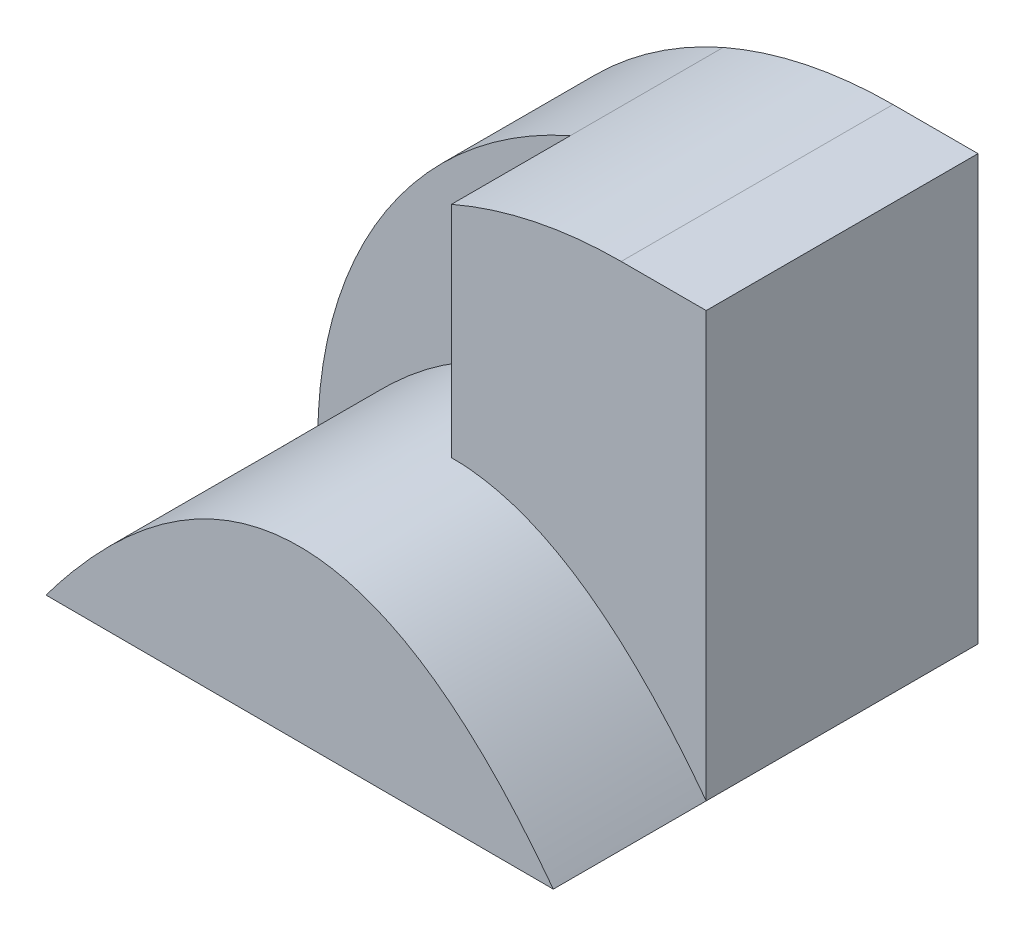
ISO-10303-21;
HEADER;
FILE_DESCRIPTION(('STEP AP214'),'2;1');
FILE_NAME('part.step','',(''),(''),'','','');
FILE_SCHEMA(('AUTOMOTIVE_DESIGN { 1 0 10303 214 1 1 1 1 }'));
ENDSEC;
DATA;
#1=APPLICATION_CONTEXT('core data for automotive mechanical design processes');
#2=APPLICATION_PROTOCOL_DEFINITION('international standard','automotive_design',2000,#1);
#3=PRODUCT_CONTEXT('',#1,'mechanical');
#4=PRODUCT('Part','Part','',(#3));
#5=PRODUCT_RELATED_PRODUCT_CATEGORY('part','',(#4));
#6=PRODUCT_DEFINITION_FORMATION('','',#4);
#7=PRODUCT_DEFINITION_CONTEXT('part definition',#1,'design');
#8=PRODUCT_DEFINITION('design','',#6,#7);
#9=PRODUCT_DEFINITION_SHAPE('','',#8);
#10=(LENGTH_UNIT() NAMED_UNIT(*) SI_UNIT(.MILLI.,.METRE.));
#11=(NAMED_UNIT(*) PLANE_ANGLE_UNIT() SI_UNIT($,.RADIAN.));
#12=(NAMED_UNIT(*) SI_UNIT($,.STERADIAN.) SOLID_ANGLE_UNIT());
#13=UNCERTAINTY_MEASURE_WITH_UNIT(LENGTH_MEASURE(1.E-05),#10,'distance_accuracy_value','');
#14=(GEOMETRIC_REPRESENTATION_CONTEXT(3) GLOBAL_UNCERTAINTY_ASSIGNED_CONTEXT((#13)) GLOBAL_UNIT_ASSIGNED_CONTEXT((#10,
#11,#12)) REPRESENTATION_CONTEXT('',''));
#15=CARTESIAN_POINT('',(0.,0.,0.));
#16=DIRECTION('',(0.,0.,1.));
#17=DIRECTION('',(1.,0.,0.));
#18=AXIS2_PLACEMENT_3D('',#15,#16,#17);
#19=CARTESIAN_POINT('',(-3.,0.,3.2));
#20=DIRECTION('',(-1.,0.,0.));
#21=DIRECTION('',(0.,0.,1.));
#22=AXIS2_PLACEMENT_3D('',#19,#20,#21);
#23=PLANE('',#22);
#24=DIRECTION('',(0.,-1.,0.));
#25=VECTOR('',#24,1.);
#26=CARTESIAN_POINT('',(-3.,4.58290207560201,1.8));
#27=LINE('',#26,#25);
#28=CARTESIAN_POINT('',(-3.,4.58290207560201,1.8));
#29=VERTEX_POINT('',#28);
#30=CARTESIAN_POINT('',(-3.,1.99999999999999,1.8));
#31=VERTEX_POINT('',#30);
#32=EDGE_CURVE('E154',#29,#31,#27,.T.);
#33=ORIENTED_EDGE('',*,*,#32,.T.);
#34=DIRECTION('',(0.,0.,-1.));
#35=VECTOR('',#34,1.);
#36=CARTESIAN_POINT('',(-3.,2.,5.));
#37=LINE('',#36,#35);
#38=CARTESIAN_POINT('',(-3.,1.99999999999999,3.2));
#39=VERTEX_POINT('',#38);
#40=EDGE_CURVE('E54',#31,#39,#37,.F.);
#41=ORIENTED_EDGE('',*,*,#40,.T.);
#42=DIRECTION('',(0.,1.,0.));
#43=VECTOR('',#42,1.);
#44=CARTESIAN_POINT('',(-3.,0.,3.2));
#45=LINE('',#44,#43);
#46=CARTESIAN_POINT('',(-3.,4.58290207560201,3.2));
#47=VERTEX_POINT('',#46);
#48=EDGE_CURVE('E179',#39,#47,#45,.T.);
#49=ORIENTED_EDGE('',*,*,#48,.T.);
#50=DIRECTION('',(0.,0.,-1.));
#51=VECTOR('',#50,1.);
#52=CARTESIAN_POINT('',(-3.,4.58290207560201,3.2));
#53=LINE('',#52,#51);
#54=EDGE_CURVE('E203',#47,#29,#53,.T.);
#55=ORIENTED_EDGE('',*,*,#54,.T.);
#56=EDGE_LOOP('',(#33,#41,#49,#55));
#57=FACE_BOUND('',#56,.T.);
#58=ADVANCED_FACE('F37',(#57),#23,.T.);
#59=CARTESIAN_POINT('',(-3.,0.,3.2));
#60=VERTEX_POINT('',#59);
#61=CARTESIAN_POINT('',(-3.,0.00608374727910583,3.2));
#62=VERTEX_POINT('',#61);
#63=EDGE_CURVE('E180',#60,#62,#45,.T.);
#64=ORIENTED_EDGE('',*,*,#63,.T.);
#65=DIRECTION('',(0.,0.,-1.));
#66=VECTOR('',#65,1.);
#67=CARTESIAN_POINT('',(-3.,0.00608374727910584,3.2));
#68=LINE('',#67,#66);
#69=CARTESIAN_POINT('',(-3.,0.00608374727910583,1.8));
#70=VERTEX_POINT('',#69);
#71=EDGE_CURVE('E138',#62,#70,#68,.T.);
#72=ORIENTED_EDGE('',*,*,#71,.T.);
#73=CARTESIAN_POINT('',(-3.,0.,1.8));
#74=VERTEX_POINT('',#73);
#75=EDGE_CURVE('E157',#70,#74,#27,.T.);
#76=ORIENTED_EDGE('',*,*,#75,.T.);
#77=DIRECTION('',(0.,0.,-1.));
#78=VECTOR('',#77,1.);
#79=CARTESIAN_POINT('',(-3.,0.,3.2));
#80=LINE('',#79,#78);
#81=EDGE_CURVE('E200',#60,#74,#80,.T.);
#82=ORIENTED_EDGE('',*,*,#81,.F.);
#83=EDGE_LOOP('',(#64,#72,#76,#82));
#84=FACE_BOUND('',#83,.T.);
#85=ADVANCED_FACE('F250',(#84),#23,.T.);
#86=CARTESIAN_POINT('',(0.,0.,3.2));
#87=DIRECTION('',(0.,0.,1.));
#88=DIRECTION('',(1.,0.,0.));
#89=AXIS2_PLACEMENT_3D('',#86,#87,#88);
#90=PLANE('',#89);
#91=ORIENTED_EDGE('',*,*,#48,.F.);
#92=CARTESIAN_POINT('',(0.,0.,3.2));
#93=CARTESIAN_POINT('',(-2.98927029749776,3.99395955215421,3.2));
#94=CARTESIAN_POINT('',(-5.97320728738098,0.0121131611940464,3.2));
#95=B_SPLINE_CURVE_WITH_KNOTS('',2,(#92,#93,#94),.UNSPECIFIED.,.F.,.F.,(3,3),(0.,1.),.UNSPECIFIED.);
#96=CARTESIAN_POINT('',(0.,0.,3.2));
#97=VERTEX_POINT('',#96);
#98=EDGE_CURVE('E145',#39,#97,#95,.F.);
#99=ORIENTED_EDGE('',*,*,#98,.T.);
#100=DIRECTION('',(0.,1.,0.));
#101=VECTOR('',#100,1.);
#102=CARTESIAN_POINT('',(0.,0.,3.2));
#103=LINE('',#102,#101);
#104=CARTESIAN_POINT('',(0.,5.,3.2));
#105=VERTEX_POINT('',#104);
#106=EDGE_CURVE('E184',#97,#105,#103,.T.);
#107=ORIENTED_EDGE('',*,*,#106,.T.);
#108=DIRECTION('',(-1.,0.,0.));
#109=VECTOR('',#108,1.);
#110=CARTESIAN_POINT('',(0.,5.,3.2));
#111=LINE('',#110,#109);
#112=CARTESIAN_POINT('',(-1.00094517956723,5.,3.2));
#113=VERTEX_POINT('',#112);
#114=EDGE_CURVE('E172',#105,#113,#111,.T.);
#115=ORIENTED_EDGE('',*,*,#114,.T.);
#116=CARTESIAN_POINT('',(-1.00094517956723,0.000945090230790058,3.2));
#117=DIRECTION('',(0.,0.,1.));
#118=DIRECTION('',(1.,0.,0.));
#119=AXIS2_PLACEMENT_3D('',#116,#117,#118);
#120=CIRCLE('',#119,4.99905490976921);
#121=EDGE_CURVE('E175',#113,#47,#120,.T.);
#122=ORIENTED_EDGE('',*,*,#121,.T.);
#123=EDGE_LOOP('',(#91,#99,#107,#115,#122));
#124=FACE_BOUND('',#123,.T.);
#125=ADVANCED_FACE('F225',(#124),#90,.T.);
#126=DIRECTION('',(1.,0.,0.));
#127=VECTOR('',#126,1.);
#128=CARTESIAN_POINT('',(0.,0.,3.2));
#129=LINE('',#128,#127);
#130=EDGE_CURVE('E182',#60,#97,#129,.T.);
#131=ORIENTED_EDGE('',*,*,#130,.T.);
#132=DIRECTION('',(-0.999997943785178,0.0020279115898715,0.));
#133=VECTOR('',#132,1.);
#134=CARTESIAN_POINT('',(0.,0.,3.2));
#135=LINE('',#134,#133);
#136=EDGE_CURVE('E62',#97,#62,#135,.T.);
#137=ORIENTED_EDGE('',*,*,#136,.T.);
#138=ORIENTED_EDGE('',*,*,#63,.F.);
#139=EDGE_LOOP('',(#131,#137,#138));
#140=FACE_BOUND('',#139,.T.);
#141=ADVANCED_FACE('F240',(#140),#90,.T.);
#142=CARTESIAN_POINT('',(-0.973207287380983,0.0121131611940813,1.8));
#143=DIRECTION('',(0.,0.,-1.));
#144=DIRECTION('',(-1.,0.,0.));
#145=AXIS2_PLACEMENT_3D('',#142,#143,#144);
#146=PLANE('',#145);
#147=CARTESIAN_POINT('',(0.,0.,1.8));
#148=CARTESIAN_POINT('',(-2.98927029749776,3.99395955215421,1.8));
#149=CARTESIAN_POINT('',(-5.97320728738098,0.0121131611940464,1.8));
#150=B_SPLINE_CURVE_WITH_KNOTS('',2,(#147,#148,#149),.UNSPECIFIED.,.F.,.F.,(3,3),(0.,1.),.UNSPECIFIED.);
#151=CARTESIAN_POINT('',(-5.97320728738098,0.0121131611940464,1.8));
#152=VERTEX_POINT('',#151);
#153=EDGE_CURVE('E11',#31,#152,#150,.T.);
#154=ORIENTED_EDGE('',*,*,#153,.F.);
#155=ORIENTED_EDGE('',*,*,#32,.F.);
#156=CARTESIAN_POINT('',(-0.973207287380983,0.0121131611940813,1.8));
#157=DIRECTION('',(0.,0.,-1.));
#158=DIRECTION('',(-1.,0.,0.));
#159=AXIS2_PLACEMENT_3D('',#156,#157,#158);
#160=CIRCLE('',#159,5.);
#161=EDGE_CURVE('E160',#152,#29,#160,.T.);
#162=ORIENTED_EDGE('',*,*,#161,.F.);
#163=EDGE_LOOP('',(#154,#155,#162));
#164=FACE_BOUND('',#163,.T.);
#165=ADVANCED_FACE('F238',(#164),#146,.F.);
#166=DIRECTION('',(0.999997943785178,-0.0020279115898715,0.));
#167=VECTOR('',#166,1.);
#168=CARTESIAN_POINT('',(0.,0.,1.8));
#169=LINE('',#168,#167);
#170=EDGE_CURVE('E134',#152,#70,#169,.T.);
#171=ORIENTED_EDGE('',*,*,#170,.F.);
#172=CARTESIAN_POINT('',(-5.97319261449204,0.,1.8));
#173=VERTEX_POINT('',#172);
#174=EDGE_CURVE('E161',#173,#152,#160,.T.);
#175=ORIENTED_EDGE('',*,*,#174,.F.);
#176=DIRECTION('',(-1.,0.,0.));
#177=VECTOR('',#176,1.);
#178=CARTESIAN_POINT('',(-3.,0.,1.8));
#179=LINE('',#178,#177);
#180=EDGE_CURVE('E156',#74,#173,#179,.T.);
#181=ORIENTED_EDGE('',*,*,#180,.F.);
#182=ORIENTED_EDGE('',*,*,#75,.F.);
#183=EDGE_LOOP('',(#171,#175,#181,#182));
#184=FACE_BOUND('',#183,.T.);
#185=ADVANCED_FACE('F236',(#184),#146,.F.);
#186=CARTESIAN_POINT('',(0.,5.,3.2));
#187=DIRECTION('',(0.,-1.,0.));
#188=DIRECTION('',(1.,0.,0.));
#189=AXIS2_PLACEMENT_3D('',#186,#187,#188);
#190=PLANE('',#189);
#191=DIRECTION('',(-1.,0.,0.));
#192=VECTOR('',#191,1.);
#193=CARTESIAN_POINT('',(0.,5.,0.));
#194=LINE('',#193,#192);
#195=CARTESIAN_POINT('',(0.,5.,0.));
#196=VERTEX_POINT('',#195);
#197=CARTESIAN_POINT('',(-1.00094517956723,5.,0.));
#198=VERTEX_POINT('',#197);
#199=EDGE_CURVE('E169',#196,#198,#194,.T.);
#200=ORIENTED_EDGE('',*,*,#199,.T.);
#201=DIRECTION('',(0.,0.,-1.));
#202=VECTOR('',#201,1.);
#203=CARTESIAN_POINT('',(-1.00094517956723,5.,3.2));
#204=LINE('',#203,#202);
#205=EDGE_CURVE('E47',#113,#198,#204,.T.);
#206=ORIENTED_EDGE('',*,*,#205,.F.);
#207=ORIENTED_EDGE('',*,*,#114,.F.);
#208=DIRECTION('',(0.,0.,-1.));
#209=VECTOR('',#208,1.);
#210=CARTESIAN_POINT('',(0.,5.,3.2));
#211=LINE('',#210,#209);
#212=EDGE_CURVE('E186',#105,#196,#211,.T.);
#213=ORIENTED_EDGE('',*,*,#212,.T.);
#214=EDGE_LOOP('',(#200,#206,#207,#213));
#215=FACE_BOUND('',#214,.T.);
#216=ADVANCED_FACE('F39',(#215),#190,.F.);
#217=CARTESIAN_POINT('',(-1.00094517956723,0.000945090230790058,3.2));
#218=DIRECTION('',(0.,0.,-1.));
#219=DIRECTION('',(-1.,0.,0.));
#220=AXIS2_PLACEMENT_3D('',#217,#218,#219);
#221=CYLINDRICAL_SURFACE('',#220,4.99905490976921);
#222=CARTESIAN_POINT('',(-1.00094517956723,0.000945090230790058,0.));
#223=DIRECTION('',(0.,0.,1.));
#224=DIRECTION('',(1.,0.,0.));
#225=AXIS2_PLACEMENT_3D('',#222,#223,#224);
#226=CIRCLE('',#225,4.99905490976921);
#227=CARTESIAN_POINT('',(-3.,4.58290207560201,0.));
#228=VERTEX_POINT('',#227);
#229=EDGE_CURVE('E189',#198,#228,#226,.T.);
#230=ORIENTED_EDGE('',*,*,#229,.T.);
#231=DIRECTION('',(0.,0.,-1.));
#232=VECTOR('',#231,1.);
#233=CARTESIAN_POINT('',(-3.,4.58290207560201,1.8));
#234=LINE('',#233,#232);
#235=EDGE_CURVE('E166',#29,#228,#234,.T.);
#236=ORIENTED_EDGE('',*,*,#235,.F.);
#237=ORIENTED_EDGE('',*,*,#54,.F.);
#238=ORIENTED_EDGE('',*,*,#121,.F.);
#239=ORIENTED_EDGE('',*,*,#205,.T.);
#240=EDGE_LOOP('',(#230,#236,#237,#238,#239));
#241=FACE_BOUND('',#240,.T.);
#242=ADVANCED_FACE('F208',(#241),#221,.T.);
#243=CARTESIAN_POINT('',(0.,0.,3.2));
#244=DIRECTION('',(0.,1.,0.));
#245=DIRECTION('',(0.,0.,1.));
#246=AXIS2_PLACEMENT_3D('',#243,#244,#245);
#247=PLANE('',#246);
#248=DIRECTION('',(1.,0.,0.));
#249=VECTOR('',#248,1.);
#250=CARTESIAN_POINT('',(0.,0.,0.));
#251=LINE('',#250,#249);
#252=CARTESIAN_POINT('',(-5.97319261449204,0.,0.));
#253=VERTEX_POINT('',#252);
#254=CARTESIAN_POINT('',(0.,0.,0.));
#255=VERTEX_POINT('',#254);
#256=EDGE_CURVE('E192',#253,#255,#251,.T.);
#257=ORIENTED_EDGE('',*,*,#256,.T.);
#258=DIRECTION('',(0.,0.,-1.));
#259=VECTOR('',#258,1.);
#260=CARTESIAN_POINT('',(0.,0.,3.2));
#261=LINE('',#260,#259);
#262=EDGE_CURVE('E198',#97,#255,#261,.T.);
#263=ORIENTED_EDGE('',*,*,#262,.F.);
#264=ORIENTED_EDGE('',*,*,#130,.F.);
#265=ORIENTED_EDGE('',*,*,#81,.T.);
#266=ORIENTED_EDGE('',*,*,#180,.T.);
#267=DIRECTION('',(0.,0.,-1.));
#268=VECTOR('',#267,1.);
#269=CARTESIAN_POINT('',(-5.97319261449204,0.,1.8));
#270=LINE('',#269,#268);
#271=EDGE_CURVE('E164',#173,#253,#270,.T.);
#272=ORIENTED_EDGE('',*,*,#271,.T.);
#273=EDGE_LOOP('',(#257,#263,#264,#265,#266,#272));
#274=FACE_BOUND('',#273,.T.);
#275=ADVANCED_FACE('F232',(#274),#247,.F.);
#276=CARTESIAN_POINT('',(0.,0.,3.2));
#277=DIRECTION('',(-1.,0.,0.));
#278=DIRECTION('',(0.,0.,1.));
#279=AXIS2_PLACEMENT_3D('',#276,#277,#278);
#280=PLANE('',#279);
#281=DIRECTION('',(0.,1.,0.));
#282=VECTOR('',#281,1.);
#283=CARTESIAN_POINT('',(0.,0.,0.));
#284=LINE('',#283,#282);
#285=EDGE_CURVE('E176',#255,#196,#284,.T.);
#286=ORIENTED_EDGE('',*,*,#285,.T.);
#287=ORIENTED_EDGE('',*,*,#212,.F.);
#288=ORIENTED_EDGE('',*,*,#106,.F.);
#289=ORIENTED_EDGE('',*,*,#262,.T.);
#290=EDGE_LOOP('',(#286,#287,#288,#289));
#291=FACE_BOUND('',#290,.T.);
#292=ADVANCED_FACE('F228',(#291),#280,.F.);
#293=CARTESIAN_POINT('',(0.,0.,0.));
#294=DIRECTION('',(0.,0.,1.));
#295=DIRECTION('',(1.,0.,0.));
#296=AXIS2_PLACEMENT_3D('',#293,#294,#295);
#297=PLANE('',#296);
#298=ORIENTED_EDGE('',*,*,#199,.F.);
#299=ORIENTED_EDGE('',*,*,#285,.F.);
#300=ORIENTED_EDGE('',*,*,#256,.F.);
#301=CARTESIAN_POINT('',(-0.973207287380983,0.0121131611940813,0.));
#302=DIRECTION('',(0.,0.,-1.));
#303=DIRECTION('',(-1.,0.,0.));
#304=AXIS2_PLACEMENT_3D('',#301,#302,#303);
#305=CIRCLE('',#304,5.);
#306=EDGE_CURVE('E153',#253,#228,#305,.T.);
#307=ORIENTED_EDGE('',*,*,#306,.T.);
#308=ORIENTED_EDGE('',*,*,#229,.F.);
#309=EDGE_LOOP('',(#298,#299,#300,#307,#308));
#310=FACE_BOUND('',#309,.T.);
#311=ADVANCED_FACE('F217',(#310),#297,.F.);
#312=CARTESIAN_POINT('',(-0.973207287380983,0.0121131611940813,1.8));
#313=DIRECTION('',(0.,0.,-1.));
#314=DIRECTION('',(-1.,0.,0.));
#315=AXIS2_PLACEMENT_3D('',#312,#313,#314);
#316=CYLINDRICAL_SURFACE('',#315,5.);
#317=ORIENTED_EDGE('',*,*,#306,.F.);
#318=ORIENTED_EDGE('',*,*,#271,.F.);
#319=ORIENTED_EDGE('',*,*,#174,.T.);
#320=ORIENTED_EDGE('',*,*,#161,.T.);
#321=ORIENTED_EDGE('',*,*,#235,.T.);
#322=EDGE_LOOP('',(#317,#318,#319,#320,#321));
#323=FACE_BOUND('',#322,.T.);
#324=ADVANCED_FACE('F220',(#323),#316,.T.);
#325=CARTESIAN_POINT('',(0.,0.,5.));
#326=CARTESIAN_POINT('',(-2.98927029749776,3.99395955215421,5.));
#327=CARTESIAN_POINT('',(-5.97320728738098,0.0121131611940464,5.));
#328=B_SPLINE_CURVE_WITH_KNOTS('',2,(#325,#326,#327),.UNSPECIFIED.,.F.,.F.,(3,3),(0.,1.),.UNSPECIFIED.);
#329=DIRECTION('',(0.,0.,-1.));
#330=VECTOR('',#329,1.);
#331=SURFACE_OF_LINEAR_EXTRUSION('',#328,#330);
#332=ORIENTED_EDGE('',*,*,#40,.F.);
#333=ORIENTED_EDGE('',*,*,#153,.T.);
#334=DIRECTION('',(0.,0.,-1.));
#335=VECTOR('',#334,1.);
#336=CARTESIAN_POINT('',(-5.97320728738098,0.0121131611940464,5.));
#337=LINE('',#336,#335);
#338=CARTESIAN_POINT('',(-5.97320728738098,0.0121131611940464,5.));
#339=VERTEX_POINT('',#338);
#340=EDGE_CURVE('E125',#339,#152,#337,.T.);
#341=ORIENTED_EDGE('',*,*,#340,.F.);
#342=CARTESIAN_POINT('',(0.,0.,5.));
#343=VERTEX_POINT('',#342);
#344=EDGE_CURVE('E130',#343,#339,#328,.T.);
#345=ORIENTED_EDGE('',*,*,#344,.F.);
#346=DIRECTION('',(0.,0.,-1.));
#347=VECTOR('',#346,1.);
#348=CARTESIAN_POINT('',(0.,0.,5.));
#349=LINE('',#348,#347);
#350=EDGE_CURVE('E127',#343,#97,#349,.T.);
#351=ORIENTED_EDGE('',*,*,#350,.T.);
#352=ORIENTED_EDGE('',*,*,#98,.F.);
#353=EDGE_LOOP('',(#332,#333,#341,#345,#351,#352));
#354=FACE_BOUND('',#353,.T.);
#355=ADVANCED_FACE('F136',(#354),#331,.F.);
#356=CARTESIAN_POINT('',(0.,0.,5.));
#357=DIRECTION('',(0.0020279115898715,0.999997943785178,0.));
#358=DIRECTION('',(-0.999997943785178,0.0020279115898715,0.));
#359=AXIS2_PLACEMENT_3D('',#356,#357,#358);
#360=PLANE('',#359);
#361=ORIENTED_EDGE('',*,*,#71,.F.);
#362=ORIENTED_EDGE('',*,*,#136,.F.);
#363=ORIENTED_EDGE('',*,*,#350,.F.);
#364=DIRECTION('',(0.999997943785178,-0.0020279115898715,0.));
#365=VECTOR('',#364,1.);
#366=CARTESIAN_POINT('',(0.,0.,5.));
#367=LINE('',#366,#365);
#368=EDGE_CURVE('E119',#339,#343,#367,.T.);
#369=ORIENTED_EDGE('',*,*,#368,.F.);
#370=ORIENTED_EDGE('',*,*,#340,.T.);
#371=ORIENTED_EDGE('',*,*,#170,.T.);
#372=EDGE_LOOP('',(#361,#362,#363,#369,#370,#371));
#373=FACE_BOUND('',#372,.T.);
#374=ADVANCED_FACE('F122',(#373),#360,.F.);
#375=CARTESIAN_POINT('',(-2.98793697059413,2.00000806637562,5.));
#376=DIRECTION('',(0.,0.,1.));
#377=DIRECTION('',(1.,0.,0.));
#378=AXIS2_PLACEMENT_3D('',#375,#376,#377);
#379=PLANE('',#378);
#380=ORIENTED_EDGE('',*,*,#344,.T.);
#381=ORIENTED_EDGE('',*,*,#368,.T.);
#382=EDGE_LOOP('',(#380,#381));
#383=FACE_BOUND('',#382,.T.);
#384=ADVANCED_FACE('F132',(#383),#379,.T.);
#385=CLOSED_SHELL('',(#58,#85,#125,#141,#165,#185,#216,#242,#275,#292,#311,#324,#355,#374,#384));
#386=MANIFOLD_SOLID_BREP('B2',#385);
#387=ADVANCED_BREP_SHAPE_REPRESENTATION('',(#18,#386),#14);
#388=SHAPE_DEFINITION_REPRESENTATION(#9,#387);
ENDSEC;
END-ISO-10303-21;
